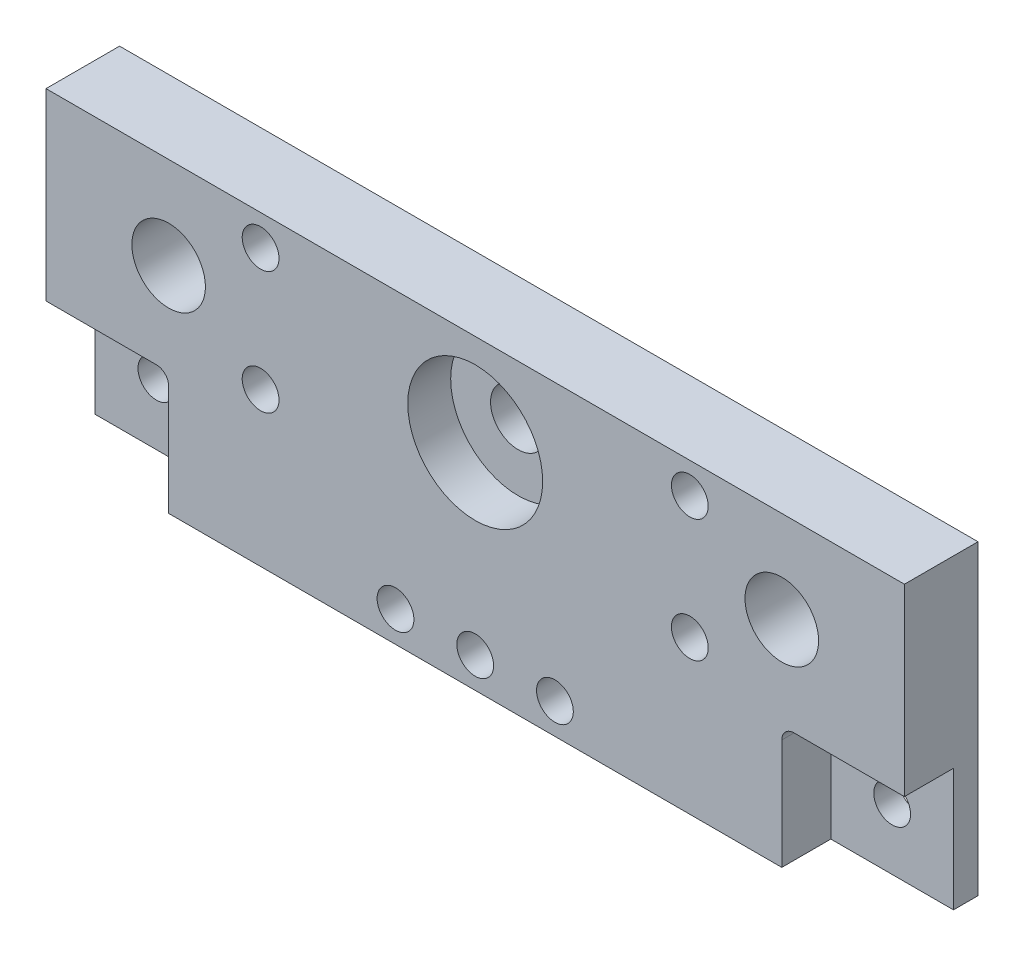
ISO-10303-21;
HEADER;
FILE_DESCRIPTION(('STEP AP214'),'2;1');
FILE_NAME('part.step','',(''),(''),'','','');
FILE_SCHEMA(('AUTOMOTIVE_DESIGN { 1 0 10303 214 1 1 1 1 }'));
ENDSEC;
DATA;
#1=APPLICATION_CONTEXT('core data for automotive mechanical design processes');
#2=APPLICATION_PROTOCOL_DEFINITION('international standard','automotive_design',2000,#1);
#3=PRODUCT_CONTEXT('',#1,'mechanical');
#4=PRODUCT('Part','Part','',(#3));
#5=PRODUCT_RELATED_PRODUCT_CATEGORY('part','',(#4));
#6=PRODUCT_DEFINITION_FORMATION('','',#4);
#7=PRODUCT_DEFINITION_CONTEXT('part definition',#1,'design');
#8=PRODUCT_DEFINITION('design','',#6,#7);
#9=PRODUCT_DEFINITION_SHAPE('','',#8);
#10=(LENGTH_UNIT() NAMED_UNIT(*) SI_UNIT(.MILLI.,.METRE.));
#11=(NAMED_UNIT(*) PLANE_ANGLE_UNIT() SI_UNIT($,.RADIAN.));
#12=(NAMED_UNIT(*) SI_UNIT($,.STERADIAN.) SOLID_ANGLE_UNIT());
#13=UNCERTAINTY_MEASURE_WITH_UNIT(LENGTH_MEASURE(1.E-05),#10,'distance_accuracy_value','');
#14=(GEOMETRIC_REPRESENTATION_CONTEXT(3) GLOBAL_UNCERTAINTY_ASSIGNED_CONTEXT((#13)) GLOBAL_UNIT_ASSIGNED_CONTEXT((#10,
#11,#12)) REPRESENTATION_CONTEXT('',''));
#15=CARTESIAN_POINT('',(0.,0.,0.));
#16=DIRECTION('',(0.,0.,1.));
#17=DIRECTION('',(1.,0.,0.));
#18=AXIS2_PLACEMENT_3D('',#15,#16,#17);
#19=CARTESIAN_POINT('',(49.9563414101724,-28.0813250382013,8.));
#20=DIRECTION('',(0.,0.,-1.));
#21=DIRECTION('',(-1.,0.,0.));
#22=AXIS2_PLACEMENT_3D('',#19,#20,#21);
#23=CYLINDRICAL_SURFACE('',#22,11.);
#24=CARTESIAN_POINT('',(49.9563414101724,-28.0813250382013,8.));
#25=DIRECTION('',(0.,0.,1.));
#26=DIRECTION('',(1.,0.,0.));
#27=AXIS2_PLACEMENT_3D('',#24,#25,#26);
#28=CIRCLE('',#27,11.);
#29=CARTESIAN_POINT('',(60.9563414101724,-28.0813250382013,8.));
#30=VERTEX_POINT('',#29);
#31=EDGE_CURVE('E234',#30,#30,#28,.T.);
#32=ORIENTED_EDGE('',*,*,#31,.T.);
#33=EDGE_LOOP('',(#32));
#34=FACE_BOUND('',#33,.T.);
#35=CARTESIAN_POINT('',(49.9563414101724,-28.0813250382013,1.));
#36=DIRECTION('',(0.,0.,-1.));
#37=DIRECTION('',(-1.,0.,0.));
#38=AXIS2_PLACEMENT_3D('',#35,#36,#37);
#39=CIRCLE('',#38,11.);
#40=CARTESIAN_POINT('',(38.9563414101724,-28.0813250382013,1.));
#41=VERTEX_POINT('',#40);
#42=EDGE_CURVE('E368',#41,#41,#39,.T.);
#43=ORIENTED_EDGE('',*,*,#42,.T.);
#44=EDGE_LOOP('',(#43));
#45=FACE_BOUND('',#44,.T.);
#46=ADVANCED_FACE('F34',(#34,#45),#23,.F.);
#47=CARTESIAN_POINT('',(-20.0436585898276,-43.0813250382013,8.));
#48=DIRECTION('',(0.,1.,0.));
#49=DIRECTION('',(0.,0.,1.));
#50=AXIS2_PLACEMENT_3D('',#47,#48,#49);
#51=PLANE('',#50);
#52=DIRECTION('',(1.,0.,0.));
#53=VECTOR('',#52,1.);
#54=CARTESIAN_POINT('',(-20.0436585898276,-43.0813250382013,0.));
#55=LINE('',#54,#53);
#56=CARTESIAN_POINT('',(-20.0436585898276,-43.0813250382013,0.));
#57=VERTEX_POINT('',#56);
#58=CARTESIAN_POINT('',(-2.04365858982757,-43.0813250382013,0.));
#59=VERTEX_POINT('',#58);
#60=EDGE_CURVE('E241',#57,#59,#55,.T.);
#61=ORIENTED_EDGE('',*,*,#60,.T.);
#62=DIRECTION('',(0.,0.,-1.));
#63=VECTOR('',#62,1.);
#64=CARTESIAN_POINT('',(-2.04365858982757,-43.0813250382013,8.));
#65=LINE('',#64,#63);
#66=CARTESIAN_POINT('',(-2.04365858982757,-43.0813250382013,8.));
#67=VERTEX_POINT('',#66);
#68=EDGE_CURVE('E265',#59,#67,#65,.F.);
#69=ORIENTED_EDGE('',*,*,#68,.T.);
#70=DIRECTION('',(1.,0.,0.));
#71=VECTOR('',#70,1.);
#72=CARTESIAN_POINT('',(-20.0436585898276,-43.0813250382013,8.));
#73=LINE('',#72,#71);
#74=CARTESIAN_POINT('',(-20.0436585898276,-43.0813250382013,8.));
#75=VERTEX_POINT('',#74);
#76=EDGE_CURVE('E242',#75,#67,#73,.T.);
#77=ORIENTED_EDGE('',*,*,#76,.F.);
#78=DIRECTION('',(0.,0.,-1.));
#79=VECTOR('',#78,1.);
#80=CARTESIAN_POINT('',(-20.0436585898276,-43.0813250382013,8.));
#81=LINE('',#80,#79);
#82=EDGE_CURVE('E274',#75,#57,#81,.T.);
#83=ORIENTED_EDGE('',*,*,#82,.T.);
#84=EDGE_LOOP('',(#61,#69,#77,#83));
#85=FACE_BOUND('',#84,.T.);
#86=ADVANCED_FACE('F312',(#85),#51,.F.);
#87=CARTESIAN_POINT('',(101.956341410172,-43.0813250382013,8.));
#88=VERTEX_POINT('',#87);
#89=CARTESIAN_POINT('',(119.956341410172,-43.0813250382013,8.));
#90=VERTEX_POINT('',#89);
#91=EDGE_CURVE('E240',#88,#90,#73,.T.);
#92=ORIENTED_EDGE('',*,*,#91,.F.);
#93=DIRECTION('',(0.,0.,-1.));
#94=VECTOR('',#93,1.);
#95=CARTESIAN_POINT('',(101.956341410172,-43.0813250382013,0.));
#96=LINE('',#95,#94);
#97=CARTESIAN_POINT('',(101.956341410172,-43.0813250382013,0.));
#98=VERTEX_POINT('',#97);
#99=EDGE_CURVE('E259',#88,#98,#96,.T.);
#100=ORIENTED_EDGE('',*,*,#99,.T.);
#101=CARTESIAN_POINT('',(119.956341410172,-43.0813250382013,0.));
#102=VERTEX_POINT('',#101);
#103=EDGE_CURVE('E237',#98,#102,#55,.T.);
#104=ORIENTED_EDGE('',*,*,#103,.T.);
#105=DIRECTION('',(0.,0.,-1.));
#106=VECTOR('',#105,1.);
#107=CARTESIAN_POINT('',(119.956341410172,-43.0813250382013,8.));
#108=LINE('',#107,#106);
#109=EDGE_CURVE('E279',#90,#102,#108,.T.);
#110=ORIENTED_EDGE('',*,*,#109,.F.);
#111=EDGE_LOOP('',(#92,#100,#104,#110));
#112=FACE_BOUND('',#111,.T.);
#113=ADVANCED_FACE('F319',(#112),#51,.F.);
#114=CARTESIAN_POINT('',(0.,0.,0.));
#115=DIRECTION('',(0.,0.,-1.));
#116=DIRECTION('',(-1.,0.,0.));
#117=AXIS2_PLACEMENT_3D('',#114,#115,#116);
#118=PLANE('',#117);
#119=CARTESIAN_POINT('',(-10.0436585898276,-53.0813250382013,0.));
#120=DIRECTION('',(0.,0.,1.));
#121=DIRECTION('',(1.,0.,0.));
#122=AXIS2_PLACEMENT_3D('',#119,#120,#121);
#123=CIRCLE('',#122,3.);
#124=CARTESIAN_POINT('',(-7.04365858982757,-53.0813250382013,0.));
#125=VERTEX_POINT('',#124);
#126=EDGE_CURVE('E170',#125,#125,#123,.T.);
#127=ORIENTED_EDGE('',*,*,#126,.F.);
#128=EDGE_LOOP('',(#127));
#129=FACE_BOUND('',#128,.T.);
#130=DIRECTION('',(0.,-1.,0.));
#131=VECTOR('',#130,1.);
#132=CARTESIAN_POINT('',(-0.0436585898275672,-43.0813250382013,0.));
#133=LINE('',#132,#131);
#134=CARTESIAN_POINT('',(-0.043658589827567,-45.0813250382013,0.));
#135=VERTEX_POINT('',#134);
#136=CARTESIAN_POINT('',(-0.0436585898275638,-63.0813250382013,0.));
#137=VERTEX_POINT('',#136);
#138=EDGE_CURVE('E149',#135,#137,#133,.T.);
#139=ORIENTED_EDGE('',*,*,#138,.F.);
#140=CARTESIAN_POINT('',(-2.04365858982757,-45.0813250382013,0.));
#141=DIRECTION('',(0.,0.,-1.));
#142=DIRECTION('',(-1.,0.,0.));
#143=AXIS2_PLACEMENT_3D('',#140,#141,#142);
#144=CIRCLE('',#143,2.);
#145=EDGE_CURVE('E266',#135,#59,#144,.F.);
#146=ORIENTED_EDGE('',*,*,#145,.T.);
#147=ORIENTED_EDGE('',*,*,#60,.F.);
#148=DIRECTION('',(0.,1.,0.));
#149=VECTOR('',#148,1.);
#150=CARTESIAN_POINT('',(-20.0436585898276,-13.0813250382013,0.));
#151=LINE('',#150,#149);
#152=CARTESIAN_POINT('',(-20.0436585898276,-63.0813250382013,0.));
#153=VERTEX_POINT('',#152);
#154=EDGE_CURVE('E183',#153,#57,#151,.T.);
#155=ORIENTED_EDGE('',*,*,#154,.F.);
#156=DIRECTION('',(-1.,0.,0.));
#157=VECTOR('',#156,1.);
#158=CARTESIAN_POINT('',(119.956341410172,-63.0813250382013,0.));
#159=LINE('',#158,#157);
#160=EDGE_CURVE('E199',#137,#153,#159,.T.);
#161=ORIENTED_EDGE('',*,*,#160,.F.);
#162=EDGE_LOOP('',(#139,#146,#147,#155,#161));
#163=FACE_BOUND('',#162,.T.);
#164=ADVANCED_FACE('F332',(#129,#163),#118,.F.);
#165=CARTESIAN_POINT('',(109.956341410172,-53.0813250382013,0.));
#166=DIRECTION('',(0.,0.,1.));
#167=DIRECTION('',(1.,0.,0.));
#168=AXIS2_PLACEMENT_3D('',#165,#166,#167);
#169=CIRCLE('',#168,3.00000000000001);
#170=CARTESIAN_POINT('',(112.956341410172,-53.0813250382013,0.));
#171=VERTEX_POINT('',#170);
#172=EDGE_CURVE('E166',#171,#171,#169,.T.);
#173=ORIENTED_EDGE('',*,*,#172,.F.);
#174=EDGE_LOOP('',(#173));
#175=FACE_BOUND('',#174,.T.);
#176=ORIENTED_EDGE('',*,*,#103,.F.);
#177=CARTESIAN_POINT('',(101.956341410172,-45.0813250382013,0.));
#178=DIRECTION('',(0.,0.,-1.));
#179=DIRECTION('',(-1.,0.,0.));
#180=AXIS2_PLACEMENT_3D('',#177,#178,#179);
#181=CIRCLE('',#180,2.);
#182=CARTESIAN_POINT('',(99.9563414101724,-45.0813250382013,0.));
#183=VERTEX_POINT('',#182);
#184=EDGE_CURVE('E56',#98,#183,#181,.F.);
#185=ORIENTED_EDGE('',*,*,#184,.T.);
#186=DIRECTION('',(0.,1.,0.));
#187=VECTOR('',#186,1.);
#188=CARTESIAN_POINT('',(99.9563414101724,-43.0813250382013,0.));
#189=LINE('',#188,#187);
#190=CARTESIAN_POINT('',(99.9563414101724,-63.0813250382013,0.));
#191=VERTEX_POINT('',#190);
#192=EDGE_CURVE('E136',#191,#183,#189,.T.);
#193=ORIENTED_EDGE('',*,*,#192,.F.);
#194=CARTESIAN_POINT('',(119.956341410172,-63.0813250382013,0.));
#195=VERTEX_POINT('',#194);
#196=EDGE_CURVE('E194',#195,#191,#159,.T.);
#197=ORIENTED_EDGE('',*,*,#196,.F.);
#198=DIRECTION('',(0.,-1.,0.));
#199=VECTOR('',#198,1.);
#200=CARTESIAN_POINT('',(119.956341410172,-13.0813250382013,0.));
#201=LINE('',#200,#199);
#202=EDGE_CURVE('E176',#102,#195,#201,.T.);
#203=ORIENTED_EDGE('',*,*,#202,.F.);
#204=EDGE_LOOP('',(#176,#185,#193,#197,#203));
#205=FACE_BOUND('',#204,.T.);
#206=ADVANCED_FACE('F324',(#175,#205),#118,.F.);
#207=CARTESIAN_POINT('',(-20.0436585898276,-43.0813250382013,8.));
#208=DIRECTION('',(0.,0.,1.));
#209=DIRECTION('',(1.,0.,0.));
#210=AXIS2_PLACEMENT_3D('',#207,#208,#209);
#211=PLANE('',#210);
#212=CARTESIAN_POINT('',(49.9563414101724,-58.0813250382013,8.));
#213=DIRECTION('',(0.,0.,1.));
#214=DIRECTION('',(1.,0.,0.));
#215=AXIS2_PLACEMENT_3D('',#212,#213,#214);
#216=CIRCLE('',#215,3.);
#217=CARTESIAN_POINT('',(52.9563414101724,-58.0813250382013,8.));
#218=VERTEX_POINT('',#217);
#219=EDGE_CURVE('E338',#218,#218,#216,.T.);
#220=ORIENTED_EDGE('',*,*,#219,.F.);
#221=EDGE_LOOP('',(#220));
#222=FACE_BOUND('',#221,.T.);
#223=CARTESIAN_POINT('',(36.9563414101724,-58.0813250382013,8.));
#224=DIRECTION('',(0.,0.,1.));
#225=DIRECTION('',(1.,0.,0.));
#226=AXIS2_PLACEMENT_3D('',#223,#224,#225);
#227=CIRCLE('',#226,3.);
#228=CARTESIAN_POINT('',(39.9563414101724,-58.0813250382013,8.));
#229=VERTEX_POINT('',#228);
#230=EDGE_CURVE('E342',#229,#229,#227,.T.);
#231=ORIENTED_EDGE('',*,*,#230,.F.);
#232=EDGE_LOOP('',(#231));
#233=FACE_BOUND('',#232,.T.);
#234=CARTESIAN_POINT('',(62.9563414101724,-58.0813250382013,8.));
#235=DIRECTION('',(0.,0.,1.));
#236=DIRECTION('',(1.,0.,0.));
#237=AXIS2_PLACEMENT_3D('',#234,#235,#236);
#238=CIRCLE('',#237,3.00000000000001);
#239=CARTESIAN_POINT('',(65.9563414101724,-58.0813250382013,8.));
#240=VERTEX_POINT('',#239);
#241=EDGE_CURVE('E346',#240,#240,#238,.T.);
#242=ORIENTED_EDGE('',*,*,#241,.F.);
#243=EDGE_LOOP('',(#242));
#244=FACE_BOUND('',#243,.T.);
#245=CARTESIAN_POINT('',(84.9563414101724,-18.0813250382013,8.));
#246=DIRECTION('',(0.,0.,1.));
#247=DIRECTION('',(1.,0.,0.));
#248=AXIS2_PLACEMENT_3D('',#245,#246,#247);
#249=CIRCLE('',#248,3.00000000000001);
#250=CARTESIAN_POINT('',(87.9563414101724,-18.0813250382013,8.));
#251=VERTEX_POINT('',#250);
#252=EDGE_CURVE('E215',#251,#251,#249,.T.);
#253=ORIENTED_EDGE('',*,*,#252,.F.);
#254=EDGE_LOOP('',(#253));
#255=FACE_BOUND('',#254,.T.);
#256=CARTESIAN_POINT('',(14.9563414101724,-18.0813250382013,8.));
#257=DIRECTION('',(0.,0.,1.));
#258=DIRECTION('',(1.,0.,0.));
#259=AXIS2_PLACEMENT_3D('',#256,#257,#258);
#260=CIRCLE('',#259,3.);
#261=CARTESIAN_POINT('',(17.9563414101724,-18.0813250382013,8.));
#262=VERTEX_POINT('',#261);
#263=EDGE_CURVE('E223',#262,#262,#260,.T.);
#264=ORIENTED_EDGE('',*,*,#263,.F.);
#265=EDGE_LOOP('',(#264));
#266=FACE_BOUND('',#265,.T.);
#267=CARTESIAN_POINT('',(-0.0436585898275915,-28.0813250382013,8.));
#268=DIRECTION('',(0.,0.,1.));
#269=DIRECTION('',(1.,0.,0.));
#270=AXIS2_PLACEMENT_3D('',#267,#268,#269);
#271=CIRCLE('',#270,6.);
#272=CARTESIAN_POINT('',(5.95634141017241,-28.0813250382013,8.));
#273=VERTEX_POINT('',#272);
#274=EDGE_CURVE('E231',#273,#273,#271,.T.);
#275=ORIENTED_EDGE('',*,*,#274,.F.);
#276=EDGE_LOOP('',(#275));
#277=FACE_BOUND('',#276,.T.);
#278=DIRECTION('',(0.,-1.,0.));
#279=VECTOR('',#278,1.);
#280=CARTESIAN_POINT('',(-20.0436585898276,-13.0813250382013,8.));
#281=LINE('',#280,#279);
#282=CARTESIAN_POINT('',(-20.0436585898276,-13.0813250382013,8.));
#283=VERTEX_POINT('',#282);
#284=EDGE_CURVE('E238',#283,#75,#281,.T.);
#285=ORIENTED_EDGE('',*,*,#284,.T.);
#286=ORIENTED_EDGE('',*,*,#76,.T.);
#287=CARTESIAN_POINT('',(-2.04365858982757,-45.0813250382013,8.));
#288=DIRECTION('',(0.,0.,1.));
#289=DIRECTION('',(1.,0.,0.));
#290=AXIS2_PLACEMENT_3D('',#287,#288,#289);
#291=CIRCLE('',#290,2.);
#292=CARTESIAN_POINT('',(-0.043658589827567,-45.0813250382013,8.));
#293=VERTEX_POINT('',#292);
#294=EDGE_CURVE('E131',#67,#293,#291,.F.);
#295=ORIENTED_EDGE('',*,*,#294,.T.);
#296=DIRECTION('',(0.,-1.,0.));
#297=VECTOR('',#296,1.);
#298=CARTESIAN_POINT('',(-0.0436585898275672,-43.0813250382013,8.));
#299=LINE('',#298,#297);
#300=CARTESIAN_POINT('',(-0.0436585898275646,-63.0813250382013,8.));
#301=VERTEX_POINT('',#300);
#302=EDGE_CURVE('E122',#293,#301,#299,.T.);
#303=ORIENTED_EDGE('',*,*,#302,.T.);
#304=DIRECTION('',(1.,0.,0.));
#305=VECTOR('',#304,1.);
#306=CARTESIAN_POINT('',(-0.0436585898275646,-63.0813250382013,8.));
#307=LINE('',#306,#305);
#308=CARTESIAN_POINT('',(99.9563414101724,-63.0813250382013,8.));
#309=VERTEX_POINT('',#308);
#310=EDGE_CURVE('E127',#301,#309,#307,.T.);
#311=ORIENTED_EDGE('',*,*,#310,.T.);
#312=DIRECTION('',(0.,1.,0.));
#313=VECTOR('',#312,1.);
#314=CARTESIAN_POINT('',(99.9563414101724,-43.0813250382013,8.));
#315=LINE('',#314,#313);
#316=CARTESIAN_POINT('',(99.9563414101724,-45.0813250382013,8.));
#317=VERTEX_POINT('',#316);
#318=EDGE_CURVE('E145',#309,#317,#315,.T.);
#319=ORIENTED_EDGE('',*,*,#318,.T.);
#320=CARTESIAN_POINT('',(101.956341410172,-45.0813250382013,8.));
#321=DIRECTION('',(0.,0.,1.));
#322=DIRECTION('',(1.,0.,0.));
#323=AXIS2_PLACEMENT_3D('',#320,#321,#322);
#324=CIRCLE('',#323,2.);
#325=EDGE_CURVE('E11',#317,#88,#324,.F.);
#326=ORIENTED_EDGE('',*,*,#325,.T.);
#327=ORIENTED_EDGE('',*,*,#91,.T.);
#328=DIRECTION('',(0.,1.,0.));
#329=VECTOR('',#328,1.);
#330=CARTESIAN_POINT('',(119.956341410172,-13.0813250382013,8.));
#331=LINE('',#330,#329);
#332=CARTESIAN_POINT('',(119.956341410172,-13.0813250382013,8.));
#333=VERTEX_POINT('',#332);
#334=EDGE_CURVE('E244',#90,#333,#331,.T.);
#335=ORIENTED_EDGE('',*,*,#334,.T.);
#336=DIRECTION('',(-1.,0.,0.));
#337=VECTOR('',#336,1.);
#338=CARTESIAN_POINT('',(-20.0436585898276,-13.0813250382013,8.));
#339=LINE('',#338,#337);
#340=EDGE_CURVE('E246',#333,#283,#339,.T.);
#341=ORIENTED_EDGE('',*,*,#340,.T.);
#342=EDGE_LOOP('',(#285,#286,#295,#303,#311,#319,#326,#327,#335,#341));
#343=FACE_BOUND('',#342,.T.);
#344=ORIENTED_EDGE('',*,*,#31,.F.);
#345=EDGE_LOOP('',(#344));
#346=FACE_BOUND('',#345,.T.);
#347=CARTESIAN_POINT('',(99.9563414101724,-28.0813250382013,8.));
#348=DIRECTION('',(0.,0.,1.));
#349=DIRECTION('',(1.,0.,0.));
#350=AXIS2_PLACEMENT_3D('',#347,#348,#349);
#351=CIRCLE('',#350,6.);
#352=CARTESIAN_POINT('',(105.956341410172,-28.0813250382013,8.));
#353=VERTEX_POINT('',#352);
#354=EDGE_CURVE('E228',#353,#353,#351,.T.);
#355=ORIENTED_EDGE('',*,*,#354,.F.);
#356=EDGE_LOOP('',(#355));
#357=FACE_BOUND('',#356,.T.);
#358=CARTESIAN_POINT('',(14.9563414101724,-38.0813250382013,8.));
#359=DIRECTION('',(0.,0.,1.));
#360=DIRECTION('',(1.,0.,0.));
#361=AXIS2_PLACEMENT_3D('',#358,#359,#360);
#362=CIRCLE('',#361,3.);
#363=CARTESIAN_POINT('',(17.9563414101724,-38.0813250382013,8.));
#364=VERTEX_POINT('',#363);
#365=EDGE_CURVE('E219',#364,#364,#362,.T.);
#366=ORIENTED_EDGE('',*,*,#365,.F.);
#367=EDGE_LOOP('',(#366));
#368=FACE_BOUND('',#367,.T.);
#369=CARTESIAN_POINT('',(84.9563414101724,-38.0813250382013,8.));
#370=DIRECTION('',(0.,0.,1.));
#371=DIRECTION('',(1.,0.,0.));
#372=AXIS2_PLACEMENT_3D('',#369,#370,#371);
#373=CIRCLE('',#372,3.00000000000001);
#374=CARTESIAN_POINT('',(87.9563414101724,-38.0813250382013,8.));
#375=VERTEX_POINT('',#374);
#376=EDGE_CURVE('E204',#375,#375,#373,.T.);
#377=ORIENTED_EDGE('',*,*,#376,.F.);
#378=EDGE_LOOP('',(#377));
#379=FACE_BOUND('',#378,.T.);
#380=ADVANCED_FACE('F125',(#222,#233,#244,#255,#266,#277,#343,#346,#357,#368,#379),#211,.T.);
#381=CARTESIAN_POINT('',(-20.0436585898276,-13.0813250382013,8.));
#382=DIRECTION('',(1.,0.,0.));
#383=DIRECTION('',(0.,0.,-1.));
#384=AXIS2_PLACEMENT_3D('',#381,#382,#383);
#385=PLANE('',#384);
#386=DIRECTION('',(0.,0.,-1.));
#387=VECTOR('',#386,1.);
#388=CARTESIAN_POINT('',(-20.0436585898276,-13.0813250382013,8.));
#389=LINE('',#388,#387);
#390=CARTESIAN_POINT('',(-20.0436585898276,-13.0813250382013,-4.));
#391=VERTEX_POINT('',#390);
#392=EDGE_CURVE('E248',#283,#391,#389,.T.);
#393=ORIENTED_EDGE('',*,*,#392,.T.);
#394=DIRECTION('',(0.,1.,0.));
#395=VECTOR('',#394,1.);
#396=CARTESIAN_POINT('',(-20.0436585898276,-13.0813250382013,-4.));
#397=LINE('',#396,#395);
#398=CARTESIAN_POINT('',(-20.0436585898276,-63.0813250382013,-4.));
#399=VERTEX_POINT('',#398);
#400=EDGE_CURVE('E185',#399,#391,#397,.T.);
#401=ORIENTED_EDGE('',*,*,#400,.F.);
#402=DIRECTION('',(0.,0.,1.));
#403=VECTOR('',#402,1.);
#404=CARTESIAN_POINT('',(-20.0436585898276,-63.0813250382013,-4.));
#405=LINE('',#404,#403);
#406=EDGE_CURVE('E191',#399,#153,#405,.T.);
#407=ORIENTED_EDGE('',*,*,#406,.T.);
#408=ORIENTED_EDGE('',*,*,#154,.T.);
#409=ORIENTED_EDGE('',*,*,#82,.F.);
#410=ORIENTED_EDGE('',*,*,#284,.F.);
#411=EDGE_LOOP('',(#393,#401,#407,#408,#409,#410));
#412=FACE_BOUND('',#411,.T.);
#413=ADVANCED_FACE('F292',(#412),#385,.F.);
#414=CARTESIAN_POINT('',(119.956341410172,-13.0813250382013,8.));
#415=DIRECTION('',(-1.,0.,0.));
#416=DIRECTION('',(0.,-1.,0.));
#417=AXIS2_PLACEMENT_3D('',#414,#415,#416);
#418=PLANE('',#417);
#419=ORIENTED_EDGE('',*,*,#109,.T.);
#420=ORIENTED_EDGE('',*,*,#202,.T.);
#421=DIRECTION('',(0.,0.,1.));
#422=VECTOR('',#421,1.);
#423=CARTESIAN_POINT('',(119.956341410172,-63.0813250382013,-4.));
#424=LINE('',#423,#422);
#425=CARTESIAN_POINT('',(119.956341410172,-63.0813250382013,-4.));
#426=VERTEX_POINT('',#425);
#427=EDGE_CURVE('E200',#426,#195,#424,.T.);
#428=ORIENTED_EDGE('',*,*,#427,.F.);
#429=DIRECTION('',(0.,-1.,0.));
#430=VECTOR('',#429,1.);
#431=CARTESIAN_POINT('',(119.956341410172,-13.0813250382013,-4.));
#432=LINE('',#431,#430);
#433=CARTESIAN_POINT('',(119.956341410172,-13.0813250382013,-4.));
#434=VERTEX_POINT('',#433);
#435=EDGE_CURVE('E179',#434,#426,#432,.T.);
#436=ORIENTED_EDGE('',*,*,#435,.F.);
#437=DIRECTION('',(0.,0.,-1.));
#438=VECTOR('',#437,1.);
#439=CARTESIAN_POINT('',(119.956341410172,-13.0813250382013,8.));
#440=LINE('',#439,#438);
#441=EDGE_CURVE('E282',#333,#434,#440,.T.);
#442=ORIENTED_EDGE('',*,*,#441,.F.);
#443=ORIENTED_EDGE('',*,*,#334,.F.);
#444=EDGE_LOOP('',(#419,#420,#428,#436,#442,#443));
#445=FACE_BOUND('',#444,.T.);
#446=ADVANCED_FACE('F300',(#445),#418,.F.);
#447=CARTESIAN_POINT('',(-20.0436585898276,-13.0813250382013,8.));
#448=DIRECTION('',(0.,-1.,0.));
#449=DIRECTION('',(0.,0.,-1.));
#450=AXIS2_PLACEMENT_3D('',#447,#448,#449);
#451=PLANE('',#450);
#452=ORIENTED_EDGE('',*,*,#441,.T.);
#453=DIRECTION('',(1.,0.,0.));
#454=VECTOR('',#453,1.);
#455=CARTESIAN_POINT('',(119.956341410172,-13.0813250382013,-4.));
#456=LINE('',#455,#454);
#457=EDGE_CURVE('E188',#391,#434,#456,.T.);
#458=ORIENTED_EDGE('',*,*,#457,.F.);
#459=ORIENTED_EDGE('',*,*,#392,.F.);
#460=ORIENTED_EDGE('',*,*,#340,.F.);
#461=EDGE_LOOP('',(#452,#458,#459,#460));
#462=FACE_BOUND('',#461,.T.);
#463=ADVANCED_FACE('F297',(#462),#451,.F.);
#464=CARTESIAN_POINT('',(-0.0436585898275915,-28.0813250382013,8.));
#465=DIRECTION('',(0.,0.,-1.));
#466=DIRECTION('',(-1.,0.,0.));
#467=AXIS2_PLACEMENT_3D('',#464,#465,#466);
#468=CYLINDRICAL_SURFACE('',#467,6.);
#469=ORIENTED_EDGE('',*,*,#274,.T.);
#470=EDGE_LOOP('',(#469));
#471=FACE_BOUND('',#470,.T.);
#472=CARTESIAN_POINT('',(-0.0436585898275915,-28.0813250382013,-2.));
#473=DIRECTION('',(0.,0.,1.));
#474=DIRECTION('',(1.,0.,0.));
#475=AXIS2_PLACEMENT_3D('',#472,#473,#474);
#476=CIRCLE('',#475,6.);
#477=CARTESIAN_POINT('',(5.95634141017241,-28.0813250382013,-2.));
#478=VERTEX_POINT('',#477);
#479=EDGE_CURVE('E354',#478,#478,#476,.T.);
#480=ORIENTED_EDGE('',*,*,#479,.F.);
#481=EDGE_LOOP('',(#480));
#482=FACE_BOUND('',#481,.T.);
#483=ADVANCED_FACE('F299',(#471,#482),#468,.F.);
#484=CARTESIAN_POINT('',(99.9563414101724,-28.0813250382013,8.));
#485=DIRECTION('',(0.,0.,-1.));
#486=DIRECTION('',(-1.,0.,0.));
#487=AXIS2_PLACEMENT_3D('',#484,#485,#486);
#488=CYLINDRICAL_SURFACE('',#487,6.);
#489=ORIENTED_EDGE('',*,*,#354,.T.);
#490=EDGE_LOOP('',(#489));
#491=FACE_BOUND('',#490,.T.);
#492=CARTESIAN_POINT('',(99.9563414101724,-28.0813250382013,-2.));
#493=DIRECTION('',(0.,0.,1.));
#494=DIRECTION('',(1.,0.,0.));
#495=AXIS2_PLACEMENT_3D('',#492,#493,#494);
#496=CIRCLE('',#495,6.00000000000002);
#497=CARTESIAN_POINT('',(105.956341410172,-28.0813250382013,-2.));
#498=VERTEX_POINT('',#497);
#499=EDGE_CURVE('E357',#498,#498,#496,.T.);
#500=ORIENTED_EDGE('',*,*,#499,.F.);
#501=EDGE_LOOP('',(#500));
#502=FACE_BOUND('',#501,.T.);
#503=ADVANCED_FACE('F306',(#491,#502),#488,.F.);
#504=CARTESIAN_POINT('',(14.9563414101724,-18.0813250382013,8.));
#505=DIRECTION('',(0.,0.,-1.));
#506=DIRECTION('',(-1.,0.,0.));
#507=AXIS2_PLACEMENT_3D('',#504,#505,#506);
#508=CYLINDRICAL_SURFACE('',#507,3.);
#509=ORIENTED_EDGE('',*,*,#263,.T.);
#510=EDGE_LOOP('',(#509));
#511=FACE_BOUND('',#510,.T.);
#512=CARTESIAN_POINT('',(14.9563414101724,-18.0813250382013,-4.));
#513=DIRECTION('',(0.,0.,1.));
#514=DIRECTION('',(1.,0.,0.));
#515=AXIS2_PLACEMENT_3D('',#512,#513,#514);
#516=CIRCLE('',#515,3.);
#517=CARTESIAN_POINT('',(17.9563414101724,-18.0813250382013,-4.));
#518=VERTEX_POINT('',#517);
#519=EDGE_CURVE('E163',#518,#518,#516,.T.);
#520=ORIENTED_EDGE('',*,*,#519,.F.);
#521=EDGE_LOOP('',(#520));
#522=FACE_BOUND('',#521,.T.);
#523=ADVANCED_FACE('F411',(#511,#522),#508,.F.);
#524=CARTESIAN_POINT('',(14.9563414101724,-38.0813250382013,8.));
#525=DIRECTION('',(0.,0.,-1.));
#526=DIRECTION('',(-1.,0.,0.));
#527=AXIS2_PLACEMENT_3D('',#524,#525,#526);
#528=CYLINDRICAL_SURFACE('',#527,3.);
#529=ORIENTED_EDGE('',*,*,#365,.T.);
#530=EDGE_LOOP('',(#529));
#531=FACE_BOUND('',#530,.T.);
#532=CARTESIAN_POINT('',(14.9563414101724,-38.0813250382013,-4.));
#533=DIRECTION('',(0.,0.,1.));
#534=DIRECTION('',(1.,0.,0.));
#535=AXIS2_PLACEMENT_3D('',#532,#533,#534);
#536=CIRCLE('',#535,3.);
#537=CARTESIAN_POINT('',(17.9563414101724,-38.0813250382013,-4.));
#538=VERTEX_POINT('',#537);
#539=EDGE_CURVE('E160',#538,#538,#536,.T.);
#540=ORIENTED_EDGE('',*,*,#539,.F.);
#541=EDGE_LOOP('',(#540));
#542=FACE_BOUND('',#541,.T.);
#543=ADVANCED_FACE('F408',(#531,#542),#528,.F.);
#544=CARTESIAN_POINT('',(84.9563414101724,-18.0813250382013,8.));
#545=DIRECTION('',(0.,0.,-1.));
#546=DIRECTION('',(-1.,0.,0.));
#547=AXIS2_PLACEMENT_3D('',#544,#545,#546);
#548=CYLINDRICAL_SURFACE('',#547,3.00000000000001);
#549=ORIENTED_EDGE('',*,*,#252,.T.);
#550=EDGE_LOOP('',(#549));
#551=FACE_BOUND('',#550,.T.);
#552=CARTESIAN_POINT('',(84.9563414101724,-18.0813250382013,-4.));
#553=DIRECTION('',(0.,0.,1.));
#554=DIRECTION('',(1.,0.,0.));
#555=AXIS2_PLACEMENT_3D('',#552,#553,#554);
#556=CIRCLE('',#555,3.00000000000001);
#557=CARTESIAN_POINT('',(87.9563414101724,-18.0813250382013,-4.));
#558=VERTEX_POINT('',#557);
#559=EDGE_CURVE('E153',#558,#558,#556,.T.);
#560=ORIENTED_EDGE('',*,*,#559,.F.);
#561=EDGE_LOOP('',(#560));
#562=FACE_BOUND('',#561,.T.);
#563=ADVANCED_FACE('F405',(#551,#562),#548,.F.);
#564=CARTESIAN_POINT('',(84.9563414101724,-38.0813250382013,8.));
#565=DIRECTION('',(0.,0.,-1.));
#566=DIRECTION('',(-1.,0.,0.));
#567=AXIS2_PLACEMENT_3D('',#564,#565,#566);
#568=CYLINDRICAL_SURFACE('',#567,3.00000000000001);
#569=ORIENTED_EDGE('',*,*,#376,.T.);
#570=EDGE_LOOP('',(#569));
#571=FACE_BOUND('',#570,.T.);
#572=CARTESIAN_POINT('',(84.9563414101724,-38.0813250382013,-4.));
#573=DIRECTION('',(0.,0.,1.));
#574=DIRECTION('',(1.,0.,0.));
#575=AXIS2_PLACEMENT_3D('',#572,#573,#574);
#576=CIRCLE('',#575,3.00000000000001);
#577=CARTESIAN_POINT('',(87.9563414101724,-38.0813250382013,-4.));
#578=VERTEX_POINT('',#577);
#579=EDGE_CURVE('E150',#578,#578,#576,.T.);
#580=ORIENTED_EDGE('',*,*,#579,.F.);
#581=EDGE_LOOP('',(#580));
#582=FACE_BOUND('',#581,.T.);
#583=ADVANCED_FACE('F402',(#571,#582),#568,.F.);
#584=CARTESIAN_POINT('',(0.,0.,-4.));
#585=DIRECTION('',(0.,0.,-1.));
#586=DIRECTION('',(-1.,0.,0.));
#587=AXIS2_PLACEMENT_3D('',#584,#585,#586);
#588=PLANE('',#587);
#589=CARTESIAN_POINT('',(49.9563414101724,-58.0813250382013,-4.));
#590=DIRECTION('',(0.,0.,1.));
#591=DIRECTION('',(1.,0.,0.));
#592=AXIS2_PLACEMENT_3D('',#589,#590,#591);
#593=CIRCLE('',#592,3.);
#594=CARTESIAN_POINT('',(52.9563414101724,-58.0813250382013,-4.));
#595=VERTEX_POINT('',#594);
#596=EDGE_CURVE('E363',#595,#595,#593,.T.);
#597=ORIENTED_EDGE('',*,*,#596,.T.);
#598=EDGE_LOOP('',(#597));
#599=FACE_BOUND('',#598,.T.);
#600=CARTESIAN_POINT('',(49.9563414101724,-28.0813250382013,-4.));
#601=DIRECTION('',(0.,0.,1.));
#602=DIRECTION('',(1.,0.,0.));
#603=AXIS2_PLACEMENT_3D('',#600,#601,#602);
#604=CIRCLE('',#603,4.5);
#605=CARTESIAN_POINT('',(54.4563414101724,-28.0813250382013,-4.));
#606=VERTEX_POINT('',#605);
#607=EDGE_CURVE('E360',#606,#606,#604,.T.);
#608=ORIENTED_EDGE('',*,*,#607,.T.);
#609=EDGE_LOOP('',(#608));
#610=FACE_BOUND('',#609,.T.);
#611=ORIENTED_EDGE('',*,*,#579,.T.);
#612=EDGE_LOOP('',(#611));
#613=FACE_BOUND('',#612,.T.);
#614=ORIENTED_EDGE('',*,*,#559,.T.);
#615=EDGE_LOOP('',(#614));
#616=FACE_BOUND('',#615,.T.);
#617=ORIENTED_EDGE('',*,*,#539,.T.);
#618=EDGE_LOOP('',(#617));
#619=FACE_BOUND('',#618,.T.);
#620=ORIENTED_EDGE('',*,*,#519,.T.);
#621=EDGE_LOOP('',(#620));
#622=FACE_BOUND('',#621,.T.);
#623=CARTESIAN_POINT('',(109.956341410172,-53.0813250382013,-4.));
#624=DIRECTION('',(0.,0.,1.));
#625=DIRECTION('',(1.,0.,0.));
#626=AXIS2_PLACEMENT_3D('',#623,#624,#625);
#627=CIRCLE('',#626,3.00000000000001);
#628=CARTESIAN_POINT('',(112.956341410172,-53.0813250382013,-4.));
#629=VERTEX_POINT('',#628);
#630=EDGE_CURVE('E167',#629,#629,#627,.T.);
#631=ORIENTED_EDGE('',*,*,#630,.T.);
#632=EDGE_LOOP('',(#631));
#633=FACE_BOUND('',#632,.T.);
#634=CARTESIAN_POINT('',(-10.0436585898276,-53.0813250382013,-4.));
#635=DIRECTION('',(0.,0.,1.));
#636=DIRECTION('',(1.,0.,0.));
#637=AXIS2_PLACEMENT_3D('',#634,#635,#636);
#638=CIRCLE('',#637,3.);
#639=CARTESIAN_POINT('',(-7.04365858982757,-53.0813250382013,-4.));
#640=VERTEX_POINT('',#639);
#641=EDGE_CURVE('E173',#640,#640,#638,.T.);
#642=ORIENTED_EDGE('',*,*,#641,.T.);
#643=EDGE_LOOP('',(#642));
#644=FACE_BOUND('',#643,.T.);
#645=ORIENTED_EDGE('',*,*,#435,.T.);
#646=DIRECTION('',(-1.,0.,0.));
#647=VECTOR('',#646,1.);
#648=CARTESIAN_POINT('',(119.956341410172,-63.0813250382013,-4.));
#649=LINE('',#648,#647);
#650=EDGE_CURVE('E182',#426,#399,#649,.T.);
#651=ORIENTED_EDGE('',*,*,#650,.T.);
#652=ORIENTED_EDGE('',*,*,#400,.T.);
#653=ORIENTED_EDGE('',*,*,#457,.T.);
#654=EDGE_LOOP('',(#645,#651,#652,#653));
#655=FACE_BOUND('',#654,.T.);
#656=ADVANCED_FACE('F295',(#599,#610,#613,#616,#619,#622,#633,#644,#655),#588,.T.);
#657=CARTESIAN_POINT('',(119.956341410172,-63.0813250382013,-4.));
#658=DIRECTION('',(0.,1.,0.));
#659=DIRECTION('',(0.,0.,1.));
#660=AXIS2_PLACEMENT_3D('',#657,#658,#659);
#661=PLANE('',#660);
#662=ORIENTED_EDGE('',*,*,#196,.T.);
#663=DIRECTION('',(0.,0.,-1.));
#664=VECTOR('',#663,1.);
#665=CARTESIAN_POINT('',(99.9563414101724,-63.0813250382013,8.));
#666=LINE('',#665,#664);
#667=EDGE_CURVE('E144',#309,#191,#666,.T.);
#668=ORIENTED_EDGE('',*,*,#667,.F.);
#669=ORIENTED_EDGE('',*,*,#310,.F.);
#670=DIRECTION('',(0.,0.,-1.));
#671=VECTOR('',#670,1.);
#672=CARTESIAN_POINT('',(-0.0436585898275646,-63.0813250382013,8.));
#673=LINE('',#672,#671);
#674=EDGE_CURVE('E142',#301,#137,#673,.T.);
#675=ORIENTED_EDGE('',*,*,#674,.T.);
#676=ORIENTED_EDGE('',*,*,#160,.T.);
#677=ORIENTED_EDGE('',*,*,#406,.F.);
#678=ORIENTED_EDGE('',*,*,#650,.F.);
#679=ORIENTED_EDGE('',*,*,#427,.T.);
#680=EDGE_LOOP('',(#662,#668,#669,#675,#676,#677,#678,#679));
#681=FACE_BOUND('',#680,.T.);
#682=ADVANCED_FACE('F141',(#681),#661,.F.);
#683=CARTESIAN_POINT('',(-10.0436585898276,-53.0813250382013,-4.));
#684=DIRECTION('',(0.,0.,1.));
#685=DIRECTION('',(1.,0.,0.));
#686=AXIS2_PLACEMENT_3D('',#683,#684,#685);
#687=CYLINDRICAL_SURFACE('',#686,3.);
#688=ORIENTED_EDGE('',*,*,#641,.F.);
#689=EDGE_LOOP('',(#688));
#690=FACE_BOUND('',#689,.T.);
#691=ORIENTED_EDGE('',*,*,#126,.T.);
#692=EDGE_LOOP('',(#691));
#693=FACE_BOUND('',#692,.T.);
#694=ADVANCED_FACE('F401',(#690,#693),#687,.F.);
#695=CARTESIAN_POINT('',(109.956341410172,-53.0813250382013,-4.));
#696=DIRECTION('',(0.,0.,1.));
#697=DIRECTION('',(1.,0.,0.));
#698=AXIS2_PLACEMENT_3D('',#695,#696,#697);
#699=CYLINDRICAL_SURFACE('',#698,3.00000000000001);
#700=ORIENTED_EDGE('',*,*,#630,.F.);
#701=EDGE_LOOP('',(#700));
#702=FACE_BOUND('',#701,.T.);
#703=ORIENTED_EDGE('',*,*,#172,.T.);
#704=EDGE_LOOP('',(#703));
#705=FACE_BOUND('',#704,.T.);
#706=ADVANCED_FACE('F462',(#702,#705),#699,.F.);
#707=CARTESIAN_POINT('',(-0.0436585898275672,-43.0813250382013,8.));
#708=DIRECTION('',(1.,0.,0.));
#709=DIRECTION('',(0.,1.,0.));
#710=AXIS2_PLACEMENT_3D('',#707,#708,#709);
#711=PLANE('',#710);
#712=ORIENTED_EDGE('',*,*,#302,.F.);
#713=DIRECTION('',(0.,0.,-1.));
#714=VECTOR('',#713,1.);
#715=CARTESIAN_POINT('',(-0.043658589827567,-45.0813250382013,0.));
#716=LINE('',#715,#714);
#717=EDGE_CURVE('E270',#293,#135,#716,.T.);
#718=ORIENTED_EDGE('',*,*,#717,.T.);
#719=ORIENTED_EDGE('',*,*,#138,.T.);
#720=ORIENTED_EDGE('',*,*,#674,.F.);
#721=EDGE_LOOP('',(#712,#718,#719,#720));
#722=FACE_BOUND('',#721,.T.);
#723=ADVANCED_FACE('F147',(#722),#711,.F.);
#724=CARTESIAN_POINT('',(99.9563414101724,-43.0813250382013,8.));
#725=DIRECTION('',(-1.,0.,0.));
#726=DIRECTION('',(0.,0.,1.));
#727=AXIS2_PLACEMENT_3D('',#724,#725,#726);
#728=PLANE('',#727);
#729=ORIENTED_EDGE('',*,*,#192,.T.);
#730=DIRECTION('',(0.,0.,-1.));
#731=VECTOR('',#730,1.);
#732=CARTESIAN_POINT('',(99.9563414101724,-45.0813250382013,8.));
#733=LINE('',#732,#731);
#734=EDGE_CURVE('E42',#183,#317,#733,.F.);
#735=ORIENTED_EDGE('',*,*,#734,.T.);
#736=ORIENTED_EDGE('',*,*,#318,.F.);
#737=ORIENTED_EDGE('',*,*,#667,.T.);
#738=EDGE_LOOP('',(#729,#735,#736,#737));
#739=FACE_BOUND('',#738,.T.);
#740=ADVANCED_FACE('F381',(#739),#728,.F.);
#741=CARTESIAN_POINT('',(62.9563414101724,-58.0813250382013,0.));
#742=DIRECTION('',(0.,0.,1.));
#743=DIRECTION('',(1.,0.,0.));
#744=AXIS2_PLACEMENT_3D('',#741,#742,#743);
#745=CYLINDRICAL_SURFACE('',#744,3.00000000000001);
#746=CARTESIAN_POINT('',(62.9563414101724,-58.0813250382013,0.));
#747=DIRECTION('',(0.,0.,1.));
#748=DIRECTION('',(1.,0.,0.));
#749=AXIS2_PLACEMENT_3D('',#746,#747,#748);
#750=CIRCLE('',#749,3.00000000000001);
#751=CARTESIAN_POINT('',(65.9563414101724,-58.0813250382013,0.));
#752=VERTEX_POINT('',#751);
#753=EDGE_CURVE('E376',#752,#752,#750,.T.);
#754=ORIENTED_EDGE('',*,*,#753,.F.);
#755=EDGE_LOOP('',(#754));
#756=FACE_BOUND('',#755,.T.);
#757=ORIENTED_EDGE('',*,*,#241,.T.);
#758=EDGE_LOOP('',(#757));
#759=FACE_BOUND('',#758,.T.);
#760=ADVANCED_FACE('F455',(#756,#759),#745,.F.);
#761=CARTESIAN_POINT('',(62.9563414101724,-58.0813250382013,0.));
#762=DIRECTION('',(0.,0.,1.));
#763=DIRECTION('',(1.,0.,0.));
#764=AXIS2_PLACEMENT_3D('',#761,#762,#763);
#765=PLANE('',#764);
#766=ORIENTED_EDGE('',*,*,#753,.T.);
#767=EDGE_LOOP('',(#766));
#768=FACE_BOUND('',#767,.T.);
#769=ADVANCED_FACE('F451',(#768),#765,.T.);
#770=CARTESIAN_POINT('',(36.9563414101724,-58.0813250382013,0.));
#771=DIRECTION('',(0.,0.,1.));
#772=DIRECTION('',(1.,0.,0.));
#773=AXIS2_PLACEMENT_3D('',#770,#771,#772);
#774=CYLINDRICAL_SURFACE('',#773,3.);
#775=CARTESIAN_POINT('',(36.9563414101724,-58.0813250382013,0.));
#776=DIRECTION('',(0.,0.,1.));
#777=DIRECTION('',(1.,0.,0.));
#778=AXIS2_PLACEMENT_3D('',#775,#776,#777);
#779=CIRCLE('',#778,3.);
#780=CARTESIAN_POINT('',(39.9563414101724,-58.0813250382013,0.));
#781=VERTEX_POINT('',#780);
#782=EDGE_CURVE('E372',#781,#781,#779,.T.);
#783=ORIENTED_EDGE('',*,*,#782,.F.);
#784=EDGE_LOOP('',(#783));
#785=FACE_BOUND('',#784,.T.);
#786=ORIENTED_EDGE('',*,*,#230,.T.);
#787=EDGE_LOOP('',(#786));
#788=FACE_BOUND('',#787,.T.);
#789=ADVANCED_FACE('F447',(#785,#788),#774,.F.);
#790=CARTESIAN_POINT('',(36.9563414101724,-58.0813250382013,0.));
#791=DIRECTION('',(0.,0.,1.));
#792=DIRECTION('',(1.,0.,0.));
#793=AXIS2_PLACEMENT_3D('',#790,#791,#792);
#794=PLANE('',#793);
#795=ORIENTED_EDGE('',*,*,#782,.T.);
#796=EDGE_LOOP('',(#795));
#797=FACE_BOUND('',#796,.T.);
#798=ADVANCED_FACE('F443',(#797),#794,.T.);
#799=CARTESIAN_POINT('',(49.9563414101724,-28.0813250382013,1.));
#800=DIRECTION('',(0.,0.,-1.));
#801=DIRECTION('',(-1.,0.,0.));
#802=AXIS2_PLACEMENT_3D('',#799,#800,#801);
#803=PLANE('',#802);
#804=CARTESIAN_POINT('',(49.9563414101724,-28.0813250382013,1.));
#805=DIRECTION('',(0.,0.,1.));
#806=DIRECTION('',(1.,0.,0.));
#807=AXIS2_PLACEMENT_3D('',#804,#805,#806);
#808=CIRCLE('',#807,4.5);
#809=CARTESIAN_POINT('',(54.4563414101724,-28.0813250382013,1.));
#810=VERTEX_POINT('',#809);
#811=EDGE_CURVE('E356',#810,#810,#808,.T.);
#812=ORIENTED_EDGE('',*,*,#811,.F.);
#813=EDGE_LOOP('',(#812));
#814=FACE_BOUND('',#813,.T.);
#815=ORIENTED_EDGE('',*,*,#42,.F.);
#816=EDGE_LOOP('',(#815));
#817=FACE_BOUND('',#816,.T.);
#818=ADVANCED_FACE('F439',(#814,#817),#803,.F.);
#819=CARTESIAN_POINT('',(49.9563414101724,-28.0813250382013,-4.));
#820=DIRECTION('',(0.,0.,1.));
#821=DIRECTION('',(1.,0.,0.));
#822=AXIS2_PLACEMENT_3D('',#819,#820,#821);
#823=CYLINDRICAL_SURFACE('',#822,4.5);
#824=ORIENTED_EDGE('',*,*,#607,.F.);
#825=EDGE_LOOP('',(#824));
#826=FACE_BOUND('',#825,.T.);
#827=ORIENTED_EDGE('',*,*,#811,.T.);
#828=EDGE_LOOP('',(#827));
#829=FACE_BOUND('',#828,.T.);
#830=ADVANCED_FACE('F434',(#826,#829),#823,.F.);
#831=CARTESIAN_POINT('',(-0.0436585898275915,-28.0813250382013,-2.));
#832=DIRECTION('',(0.,0.,1.));
#833=DIRECTION('',(1.,0.,0.));
#834=AXIS2_PLACEMENT_3D('',#831,#832,#833);
#835=PLANE('',#834);
#836=ORIENTED_EDGE('',*,*,#479,.T.);
#837=EDGE_LOOP('',(#836));
#838=FACE_BOUND('',#837,.T.);
#839=ADVANCED_FACE('F426',(#838),#835,.T.);
#840=CARTESIAN_POINT('',(99.9563414101724,-28.0813250382013,-2.));
#841=DIRECTION('',(0.,0.,1.));
#842=DIRECTION('',(1.,0.,0.));
#843=AXIS2_PLACEMENT_3D('',#840,#841,#842);
#844=PLANE('',#843);
#845=ORIENTED_EDGE('',*,*,#499,.T.);
#846=EDGE_LOOP('',(#845));
#847=FACE_BOUND('',#846,.T.);
#848=ADVANCED_FACE('F423',(#847),#844,.T.);
#849=CARTESIAN_POINT('',(49.9563414101724,-58.0813250382013,-4.));
#850=DIRECTION('',(0.,0.,1.));
#851=DIRECTION('',(1.,0.,0.));
#852=AXIS2_PLACEMENT_3D('',#849,#850,#851);
#853=CYLINDRICAL_SURFACE('',#852,3.);
#854=ORIENTED_EDGE('',*,*,#596,.F.);
#855=EDGE_LOOP('',(#854));
#856=FACE_BOUND('',#855,.T.);
#857=ORIENTED_EDGE('',*,*,#219,.T.);
#858=EDGE_LOOP('',(#857));
#859=FACE_BOUND('',#858,.T.);
#860=ADVANCED_FACE('F425',(#856,#859),#853,.F.);
#861=CARTESIAN_POINT('',(-2.04365858982757,-45.0813250382013,8.));
#862=DIRECTION('',(0.,0.,1.));
#863=DIRECTION('',(1.,0.,0.));
#864=AXIS2_PLACEMENT_3D('',#861,#862,#863);
#865=CYLINDRICAL_SURFACE('',#864,2.);
#866=ORIENTED_EDGE('',*,*,#294,.F.);
#867=ORIENTED_EDGE('',*,*,#68,.F.);
#868=ORIENTED_EDGE('',*,*,#145,.F.);
#869=ORIENTED_EDGE('',*,*,#717,.F.);
#870=EDGE_LOOP('',(#866,#867,#868,#869));
#871=FACE_BOUND('',#870,.T.);
#872=ADVANCED_FACE('F388',(#871),#865,.F.);
#873=CARTESIAN_POINT('',(101.956341410172,-45.0813250382013,8.));
#874=DIRECTION('',(0.,0.,1.));
#875=DIRECTION('',(1.,0.,0.));
#876=AXIS2_PLACEMENT_3D('',#873,#874,#875);
#877=CYLINDRICAL_SURFACE('',#876,2.);
#878=ORIENTED_EDGE('',*,*,#325,.F.);
#879=ORIENTED_EDGE('',*,*,#734,.F.);
#880=ORIENTED_EDGE('',*,*,#184,.F.);
#881=ORIENTED_EDGE('',*,*,#99,.F.);
#882=EDGE_LOOP('',(#878,#879,#880,#881));
#883=FACE_BOUND('',#882,.T.);
#884=ADVANCED_FACE('F36',(#883),#877,.F.);
#885=CLOSED_SHELL('',(#46,#86,#113,#164,#206,#380,#413,#446,#463,#483,#503,#523,#543,#563,#583,
#656,#682,#694,#706,#723,#740,#760,#769,#789,#798,#818,#830,#839,#848,#860,#872,#884));
#886=MANIFOLD_SOLID_BREP('B2',#885);
#887=ADVANCED_BREP_SHAPE_REPRESENTATION('',(#18,#886),#14);
#888=SHAPE_DEFINITION_REPRESENTATION(#9,#887);
ENDSEC;
END-ISO-10303-21;
